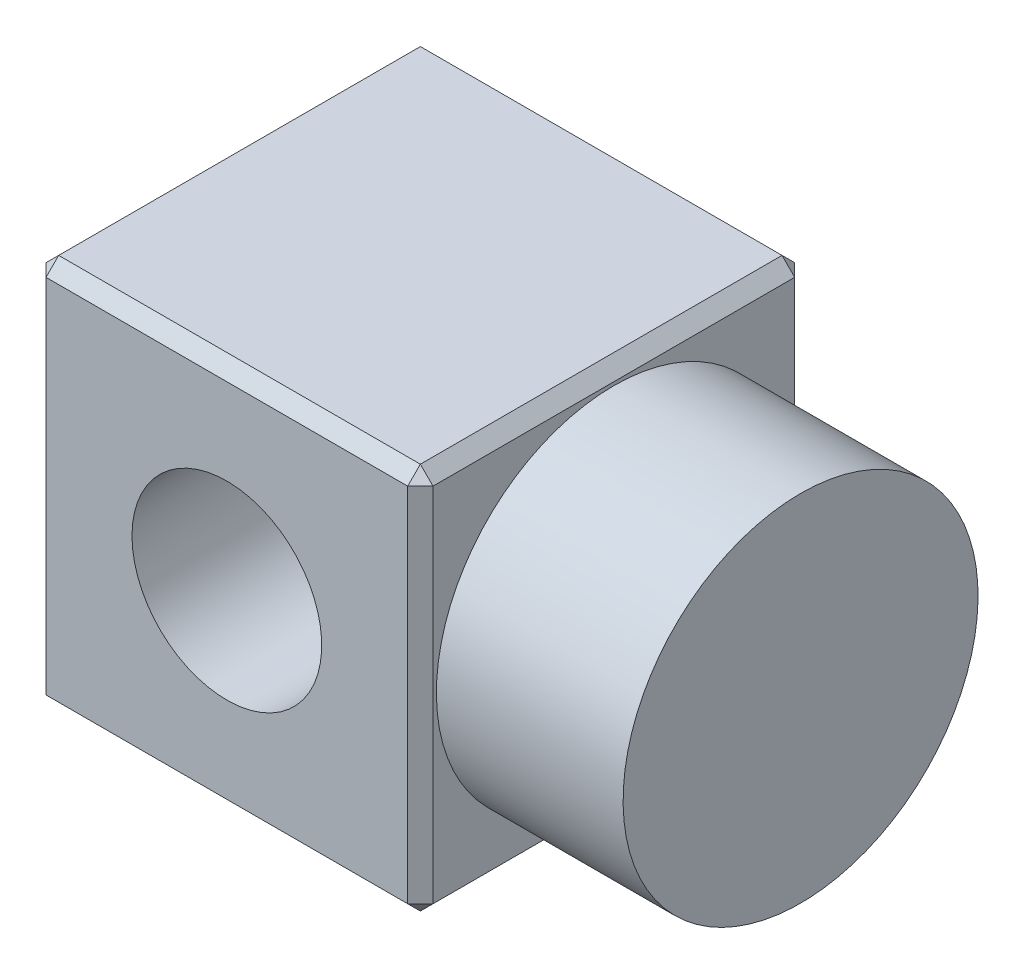
ISO-10303-21;
HEADER;
FILE_DESCRIPTION(('STEP AP214'),'2;1');
FILE_NAME('part.step','',(''),(''),'','','');
FILE_SCHEMA(('AUTOMOTIVE_DESIGN { 1 0 10303 214 1 1 1 1 }'));
ENDSEC;
DATA;
#1=APPLICATION_CONTEXT('core data for automotive mechanical design processes');
#2=APPLICATION_PROTOCOL_DEFINITION('international standard','automotive_design',2000,#1);
#3=PRODUCT_CONTEXT('',#1,'mechanical');
#4=PRODUCT('Part','Part','',(#3));
#5=PRODUCT_RELATED_PRODUCT_CATEGORY('part','',(#4));
#6=PRODUCT_DEFINITION_FORMATION('','',#4);
#7=PRODUCT_DEFINITION_CONTEXT('part definition',#1,'design');
#8=PRODUCT_DEFINITION('design','',#6,#7);
#9=PRODUCT_DEFINITION_SHAPE('','',#8);
#10=(LENGTH_UNIT() NAMED_UNIT(*) SI_UNIT(.MILLI.,.METRE.));
#11=(NAMED_UNIT(*) PLANE_ANGLE_UNIT() SI_UNIT($,.RADIAN.));
#12=(NAMED_UNIT(*) SI_UNIT($,.STERADIAN.) SOLID_ANGLE_UNIT());
#13=UNCERTAINTY_MEASURE_WITH_UNIT(LENGTH_MEASURE(1.E-05),#10,'distance_accuracy_value','');
#14=(GEOMETRIC_REPRESENTATION_CONTEXT(3) GLOBAL_UNCERTAINTY_ASSIGNED_CONTEXT((#13)) GLOBAL_UNIT_ASSIGNED_CONTEXT((#10,
#11,#12)) REPRESENTATION_CONTEXT('',''));
#15=CARTESIAN_POINT('',(0.,0.,0.));
#16=DIRECTION('',(0.,0.,1.));
#17=DIRECTION('',(1.,0.,0.));
#18=AXIS2_PLACEMENT_3D('',#15,#16,#17);
#19=CARTESIAN_POINT('',(1772.4105175513,38.1650000000007,-38.1650000000001));
#20=DIRECTION('',(0.,1.,0.));
#21=DIRECTION('',(-1.,0.,0.));
#22=AXIS2_PLACEMENT_3D('',#19,#20,#21);
#23=PLANE('',#22);
#24=DIRECTION('',(0.,0.,-1.));
#25=VECTOR('',#24,1.);
#26=CARTESIAN_POINT('',(1846.2405175513,38.1650000000008,-38.1650000000001));
#27=LINE('',#26,#25);
#28=CARTESIAN_POINT('',(1846.2405175513,38.1650000000008,35.665));
#29=VERTEX_POINT('',#28);
#30=CARTESIAN_POINT('',(1846.2405175513,38.1650000000008,-35.6650000000001));
#31=VERTEX_POINT('',#30);
#32=EDGE_CURVE('E180',#29,#31,#27,.T.);
#33=ORIENTED_EDGE('',*,*,#32,.T.);
#34=DIRECTION('',(-1.,0.,0.));
#35=VECTOR('',#34,1.);
#36=CARTESIAN_POINT('',(1772.4105175513,38.1650000000007,-35.6650000000001));
#37=LINE('',#36,#35);
#38=CARTESIAN_POINT('',(1774.9105175513,38.1650000000007,-35.6650000000001));
#39=VERTEX_POINT('',#38);
#40=EDGE_CURVE('E182',#31,#39,#37,.T.);
#41=ORIENTED_EDGE('',*,*,#40,.T.);
#42=DIRECTION('',(0.,0.,1.));
#43=VECTOR('',#42,1.);
#44=CARTESIAN_POINT('',(1774.9105175513,38.1650000000007,-38.1650000000001));
#45=LINE('',#44,#43);
#46=CARTESIAN_POINT('',(1774.9105175513,38.1650000000007,35.665));
#47=VERTEX_POINT('',#46);
#48=EDGE_CURVE('E176',#39,#47,#45,.T.);
#49=ORIENTED_EDGE('',*,*,#48,.T.);
#50=DIRECTION('',(1.,0.,0.));
#51=VECTOR('',#50,1.);
#52=CARTESIAN_POINT('',(1848.7405175513,38.1650000000008,35.665));
#53=LINE('',#52,#51);
#54=EDGE_CURVE('E178',#47,#29,#53,.T.);
#55=ORIENTED_EDGE('',*,*,#54,.T.);
#56=EDGE_LOOP('',(#33,#41,#49,#55));
#57=FACE_BOUND('',#56,.T.);
#58=ADVANCED_FACE('F33',(#57),#23,.T.);
#59=CARTESIAN_POINT('',(1772.4105175513,-38.1649999999993,-38.1650000000001));
#60=DIRECTION('',(0.,0.,-1.));
#61=DIRECTION('',(-1.,0.,0.));
#62=AXIS2_PLACEMENT_3D('',#59,#60,#61);
#63=PLANE('',#62);
#64=CARTESIAN_POINT('',(1810.5755175513,7.80625564189563E-13,-38.1650000000001));
#65=DIRECTION('',(0.,0.,-1.));
#66=DIRECTION('',(-1.,0.,0.));
#67=AXIS2_PLACEMENT_3D('',#64,#65,#66);
#68=CIRCLE('',#67,18.71);
#69=CARTESIAN_POINT('',(1791.8655175513,7.80625564189563E-13,-38.1650000000001));
#70=VERTEX_POINT('',#69);
#71=EDGE_CURVE('E272',#70,#70,#68,.T.);
#72=ORIENTED_EDGE('',*,*,#71,.F.);
#73=EDGE_LOOP('',(#72));
#74=FACE_BOUND('',#73,.T.);
#75=DIRECTION('',(1.,0.,0.));
#76=VECTOR('',#75,1.);
#77=CARTESIAN_POINT('',(1772.4105175513,35.6650000000008,-38.1650000000001));
#78=LINE('',#77,#76);
#79=CARTESIAN_POINT('',(1774.9105175513,35.6650000000008,-38.1650000000001));
#80=VERTEX_POINT('',#79);
#81=CARTESIAN_POINT('',(1846.2405175513,35.6650000000008,-38.1650000000001));
#82=VERTEX_POINT('',#81);
#83=EDGE_CURVE('E171',#80,#82,#78,.T.);
#84=ORIENTED_EDGE('',*,*,#83,.T.);
#85=DIRECTION('',(0.,-1.,0.));
#86=VECTOR('',#85,1.);
#87=CARTESIAN_POINT('',(1846.2405175513,-38.1649999999992,-38.1650000000001));
#88=LINE('',#87,#86);
#89=CARTESIAN_POINT('',(1846.2405175513,-35.6649999999992,-38.1650000000001));
#90=VERTEX_POINT('',#89);
#91=EDGE_CURVE('E173',#82,#90,#88,.T.);
#92=ORIENTED_EDGE('',*,*,#91,.T.);
#93=DIRECTION('',(-1.,0.,0.));
#94=VECTOR('',#93,1.);
#95=CARTESIAN_POINT('',(1772.4105175513,-35.6649999999993,-38.1650000000001));
#96=LINE('',#95,#94);
#97=CARTESIAN_POINT('',(1774.9105175513,-35.6649999999993,-38.1650000000001));
#98=VERTEX_POINT('',#97);
#99=EDGE_CURVE('E169',#90,#98,#96,.T.);
#100=ORIENTED_EDGE('',*,*,#99,.T.);
#101=DIRECTION('',(0.,1.,0.));
#102=VECTOR('',#101,1.);
#103=CARTESIAN_POINT('',(1774.9105175513,-38.1649999999993,-38.1650000000001));
#104=LINE('',#103,#102);
#105=EDGE_CURVE('E167',#98,#80,#104,.T.);
#106=ORIENTED_EDGE('',*,*,#105,.T.);
#107=EDGE_LOOP('',(#84,#92,#100,#106));
#108=FACE_BOUND('',#107,.T.);
#109=ADVANCED_FACE('F279',(#74,#108),#63,.T.);
#110=CARTESIAN_POINT('',(1772.4105175513,-38.1649999999993,-38.1650000000001));
#111=DIRECTION('',(0.,1.,0.));
#112=DIRECTION('',(-1.,0.,0.));
#113=AXIS2_PLACEMENT_3D('',#110,#111,#112);
#114=PLANE('',#113);
#115=DIRECTION('',(0.,0.,-1.));
#116=VECTOR('',#115,1.);
#117=CARTESIAN_POINT('',(1774.9105175513,-38.1649999999993,-38.1650000000001));
#118=LINE('',#117,#116);
#119=CARTESIAN_POINT('',(1774.9105175513,-38.1649999999993,35.665));
#120=VERTEX_POINT('',#119);
#121=CARTESIAN_POINT('',(1774.9105175513,-38.1649999999993,-35.6650000000001));
#122=VERTEX_POINT('',#121);
#123=EDGE_CURVE('E193',#120,#122,#118,.T.);
#124=ORIENTED_EDGE('',*,*,#123,.T.);
#125=DIRECTION('',(1.,0.,0.));
#126=VECTOR('',#125,1.);
#127=CARTESIAN_POINT('',(1848.7405175513,-38.1649999999992,-35.6650000000001));
#128=LINE('',#127,#126);
#129=CARTESIAN_POINT('',(1846.2405175513,-38.1649999999992,-35.6650000000001));
#130=VERTEX_POINT('',#129);
#131=EDGE_CURVE('E199',#122,#130,#128,.T.);
#132=ORIENTED_EDGE('',*,*,#131,.T.);
#133=DIRECTION('',(0.,0.,1.));
#134=VECTOR('',#133,1.);
#135=CARTESIAN_POINT('',(1846.2405175513,-38.1649999999992,-38.1650000000001));
#136=LINE('',#135,#134);
#137=CARTESIAN_POINT('',(1846.2405175513,-38.1649999999992,35.665));
#138=VERTEX_POINT('',#137);
#139=EDGE_CURVE('E197',#130,#138,#136,.T.);
#140=ORIENTED_EDGE('',*,*,#139,.T.);
#141=DIRECTION('',(-1.,0.,0.));
#142=VECTOR('',#141,1.);
#143=CARTESIAN_POINT('',(1772.4105175513,-38.1649999999993,35.665));
#144=LINE('',#143,#142);
#145=EDGE_CURVE('E195',#138,#120,#144,.T.);
#146=ORIENTED_EDGE('',*,*,#145,.T.);
#147=EDGE_LOOP('',(#124,#132,#140,#146));
#148=FACE_BOUND('',#147,.T.);
#149=ADVANCED_FACE('F282',(#148),#114,.F.);
#150=CARTESIAN_POINT('',(1772.4105175513,-38.1649999999993,38.1649999999999));
#151=DIRECTION('',(0.,0.,-1.));
#152=DIRECTION('',(-1.,0.,0.));
#153=AXIS2_PLACEMENT_3D('',#150,#151,#152);
#154=PLANE('',#153);
#155=CARTESIAN_POINT('',(1810.5755175513,7.80625564189563E-13,38.1649999999999));
#156=DIRECTION('',(0.,0.,-1.));
#157=DIRECTION('',(-1.,0.,0.));
#158=AXIS2_PLACEMENT_3D('',#155,#156,#157);
#159=CIRCLE('',#158,18.71);
#160=CARTESIAN_POINT('',(1791.8655175513,7.80625564189563E-13,38.1649999999999));
#161=VERTEX_POINT('',#160);
#162=EDGE_CURVE('E209',#161,#161,#159,.F.);
#163=ORIENTED_EDGE('',*,*,#162,.F.);
#164=EDGE_LOOP('',(#163));
#165=FACE_BOUND('',#164,.T.);
#166=DIRECTION('',(0.,1.,0.));
#167=VECTOR('',#166,1.);
#168=CARTESIAN_POINT('',(1846.2405175513,-38.1649999999993,38.1649999999999));
#169=LINE('',#168,#167);
#170=CARTESIAN_POINT('',(1846.2405175513,-35.6649999999993,38.1649999999999));
#171=VERTEX_POINT('',#170);
#172=CARTESIAN_POINT('',(1846.2405175513,35.6650000000008,38.1649999999999));
#173=VERTEX_POINT('',#172);
#174=EDGE_CURVE('E139',#171,#173,#169,.T.);
#175=ORIENTED_EDGE('',*,*,#174,.T.);
#176=DIRECTION('',(-1.,0.,0.));
#177=VECTOR('',#176,1.);
#178=CARTESIAN_POINT('',(1772.4105175513,35.6650000000008,38.1649999999999));
#179=LINE('',#178,#177);
#180=CARTESIAN_POINT('',(1774.9105175513,35.6650000000008,38.1649999999999));
#181=VERTEX_POINT('',#180);
#182=EDGE_CURVE('E190',#173,#181,#179,.T.);
#183=ORIENTED_EDGE('',*,*,#182,.T.);
#184=DIRECTION('',(0.,-1.,0.));
#185=VECTOR('',#184,1.);
#186=CARTESIAN_POINT('',(1774.9105175513,-38.1649999999993,38.1649999999999));
#187=LINE('',#186,#185);
#188=CARTESIAN_POINT('',(1774.9105175513,-35.6649999999993,38.1649999999999));
#189=VERTEX_POINT('',#188);
#190=EDGE_CURVE('E185',#181,#189,#187,.T.);
#191=ORIENTED_EDGE('',*,*,#190,.T.);
#192=DIRECTION('',(1.,0.,0.));
#193=VECTOR('',#192,1.);
#194=CARTESIAN_POINT('',(1772.4105175513,-35.6649999999993,38.1649999999999));
#195=LINE('',#194,#193);
#196=EDGE_CURVE('E187',#189,#171,#195,.T.);
#197=ORIENTED_EDGE('',*,*,#196,.T.);
#198=EDGE_LOOP('',(#175,#183,#191,#197));
#199=FACE_BOUND('',#198,.T.);
#200=ADVANCED_FACE('F311',(#165,#199),#154,.F.);
#201=CARTESIAN_POINT('',(1772.4105175513,0.,0.));
#202=DIRECTION('',(-1.,0.,0.));
#203=DIRECTION('',(0.,0.,1.));
#204=AXIS2_PLACEMENT_3D('',#201,#202,#203);
#205=PLANE('',#204);
#206=DIRECTION('',(0.,0.,1.));
#207=VECTOR('',#206,1.);
#208=CARTESIAN_POINT('',(1772.4105175513,-35.6649999999993,38.1649999999999));
#209=LINE('',#208,#207);
#210=CARTESIAN_POINT('',(1772.4105175513,-35.6649999999993,-35.6650000000001));
#211=VERTEX_POINT('',#210);
#212=CARTESIAN_POINT('',(1772.4105175513,-35.6649999999993,35.665));
#213=VERTEX_POINT('',#212);
#214=EDGE_CURVE('E42',#211,#213,#209,.T.);
#215=ORIENTED_EDGE('',*,*,#214,.T.);
#216=DIRECTION('',(0.,1.,0.));
#217=VECTOR('',#216,1.);
#218=CARTESIAN_POINT('',(1772.4105175513,38.1650000000007,35.665));
#219=LINE('',#218,#217);
#220=CARTESIAN_POINT('',(1772.4105175513,35.6650000000008,35.665));
#221=VERTEX_POINT('',#220);
#222=EDGE_CURVE('E11',#213,#221,#219,.T.);
#223=ORIENTED_EDGE('',*,*,#222,.T.);
#224=DIRECTION('',(0.,0.,-1.));
#225=VECTOR('',#224,1.);
#226=CARTESIAN_POINT('',(1772.4105175513,35.6650000000008,0.));
#227=LINE('',#226,#225);
#228=CARTESIAN_POINT('',(1772.4105175513,35.6650000000008,-35.6650000000001));
#229=VERTEX_POINT('',#228);
#230=EDGE_CURVE('E202',#221,#229,#227,.T.);
#231=ORIENTED_EDGE('',*,*,#230,.T.);
#232=DIRECTION('',(0.,-1.,0.));
#233=VECTOR('',#232,1.);
#234=CARTESIAN_POINT('',(1772.4105175513,0.,-35.6650000000001));
#235=LINE('',#234,#233);
#236=EDGE_CURVE('E53',#229,#211,#235,.T.);
#237=ORIENTED_EDGE('',*,*,#236,.T.);
#238=EDGE_LOOP('',(#215,#223,#231,#237));
#239=FACE_BOUND('',#238,.T.);
#240=ADVANCED_FACE('F358',(#239),#205,.T.);
#241=CARTESIAN_POINT('',(1848.7405175513,0.,0.));
#242=DIRECTION('',(-1.,0.,0.));
#243=DIRECTION('',(0.,0.,1.));
#244=AXIS2_PLACEMENT_3D('',#241,#242,#243);
#245=PLANE('',#244);
#246=DIRECTION('',(0.,0.,-1.));
#247=VECTOR('',#246,1.);
#248=CARTESIAN_POINT('',(1848.7405175513,-35.6649999999992,0.));
#249=LINE('',#248,#247);
#250=CARTESIAN_POINT('',(1848.7405175513,-35.6649999999992,35.665));
#251=VERTEX_POINT('',#250);
#252=CARTESIAN_POINT('',(1848.7405175513,-35.6649999999992,-35.6650000000001));
#253=VERTEX_POINT('',#252);
#254=EDGE_CURVE('E126',#251,#253,#249,.T.);
#255=ORIENTED_EDGE('',*,*,#254,.T.);
#256=DIRECTION('',(0.,1.,0.));
#257=VECTOR('',#256,1.);
#258=CARTESIAN_POINT('',(1848.7405175513,38.1650000000008,-35.6650000000001));
#259=LINE('',#258,#257);
#260=CARTESIAN_POINT('',(1848.7405175513,35.6650000000008,-35.6650000000001));
#261=VERTEX_POINT('',#260);
#262=EDGE_CURVE('E165',#253,#261,#259,.T.);
#263=ORIENTED_EDGE('',*,*,#262,.T.);
#264=DIRECTION('',(0.,0.,1.));
#265=VECTOR('',#264,1.);
#266=CARTESIAN_POINT('',(1848.7405175513,35.6650000000008,38.1649999999999));
#267=LINE('',#266,#265);
#268=CARTESIAN_POINT('',(1848.7405175513,35.6650000000008,35.665));
#269=VERTEX_POINT('',#268);
#270=EDGE_CURVE('E129',#261,#269,#267,.T.);
#271=ORIENTED_EDGE('',*,*,#270,.T.);
#272=DIRECTION('',(0.,-1.,0.));
#273=VECTOR('',#272,1.);
#274=CARTESIAN_POINT('',(1848.7405175513,0.,35.665));
#275=LINE('',#274,#273);
#276=EDGE_CURVE('E120',#269,#251,#275,.T.);
#277=ORIENTED_EDGE('',*,*,#276,.T.);
#278=EDGE_LOOP('',(#255,#263,#271,#277));
#279=FACE_BOUND('',#278,.T.);
#280=CARTESIAN_POINT('',(1848.7405175513,0.,0.));
#281=DIRECTION('',(1.,0.,0.));
#282=DIRECTION('',(0.,1.,0.));
#283=AXIS2_PLACEMENT_3D('',#280,#281,#282);
#284=CIRCLE('',#283,35.);
#285=CARTESIAN_POINT('',(1848.7405175513,35.,0.));
#286=VERTEX_POINT('',#285);
#287=EDGE_CURVE('E157',#286,#286,#284,.T.);
#288=ORIENTED_EDGE('',*,*,#287,.F.);
#289=EDGE_LOOP('',(#288));
#290=FACE_BOUND('',#289,.T.);
#291=ADVANCED_FACE('F122',(#279,#290),#245,.F.);
#292=CARTESIAN_POINT('',(1885.5605175513,0.,0.));
#293=DIRECTION('',(-1.,0.,0.));
#294=DIRECTION('',(0.,-1.,0.));
#295=AXIS2_PLACEMENT_3D('',#292,#293,#294);
#296=CYLINDRICAL_SURFACE('',#295,35.);
#297=CARTESIAN_POINT('',(1885.5605175513,0.,0.));
#298=DIRECTION('',(1.,0.,0.));
#299=DIRECTION('',(0.,1.,0.));
#300=AXIS2_PLACEMENT_3D('',#297,#298,#299);
#301=CIRCLE('',#300,35.);
#302=CARTESIAN_POINT('',(1885.5605175513,35.,0.));
#303=VERTEX_POINT('',#302);
#304=EDGE_CURVE('E160',#303,#303,#301,.T.);
#305=ORIENTED_EDGE('',*,*,#304,.F.);
#306=EDGE_LOOP('',(#305));
#307=FACE_BOUND('',#306,.T.);
#308=ORIENTED_EDGE('',*,*,#287,.T.);
#309=EDGE_LOOP('',(#308));
#310=FACE_BOUND('',#309,.T.);
#311=ADVANCED_FACE('F354',(#307,#310),#296,.T.);
#312=CARTESIAN_POINT('',(1885.5605175513,0.,0.));
#313=DIRECTION('',(1.,0.,0.));
#314=DIRECTION('',(0.,1.,0.));
#315=AXIS2_PLACEMENT_3D('',#312,#313,#314);
#316=PLANE('',#315);
#317=ORIENTED_EDGE('',*,*,#304,.T.);
#318=EDGE_LOOP('',(#317));
#319=FACE_BOUND('',#318,.T.);
#320=ADVANCED_FACE('F351',(#319),#316,.T.);
#321=CARTESIAN_POINT('',(1772.4105175513,0.,35.665));
#322=DIRECTION('',(-0.707106781186551,0.,0.707106781186544));
#323=DIRECTION('',(0.,-1.,0.));
#324=AXIS2_PLACEMENT_3D('',#321,#322,#323);
#325=PLANE('',#324);
#326=DIRECTION('',(-0.707106781186544,0.,-0.707106781186551));
#327=VECTOR('',#326,1.);
#328=CARTESIAN_POINT('',(1773.6605175513,-35.6649999999993,36.9149999999999));
#329=LINE('',#328,#327);
#330=EDGE_CURVE('E37',#189,#213,#329,.T.);
#331=ORIENTED_EDGE('',*,*,#330,.F.);
#332=ORIENTED_EDGE('',*,*,#190,.F.);
#333=DIRECTION('',(0.707106781186544,0.,0.707106781186551));
#334=VECTOR('',#333,1.);
#335=CARTESIAN_POINT('',(1774.9105175513,35.6650000000008,38.1649999999999));
#336=LINE('',#335,#334);
#337=EDGE_CURVE('E254',#221,#181,#336,.T.);
#338=ORIENTED_EDGE('',*,*,#337,.F.);
#339=ORIENTED_EDGE('',*,*,#222,.F.);
#340=EDGE_LOOP('',(#331,#332,#338,#339));
#341=FACE_BOUND('',#340,.T.);
#342=ADVANCED_FACE('F35',(#341),#325,.T.);
#343=CARTESIAN_POINT('',(1774.9105175513,-38.1649999999993,35.665));
#344=DIRECTION('',(-0.577350269189632,-0.577350269189626,0.577350269189619));
#345=DIRECTION('',(0.707106781186544,-0.707106781186551,0.));
#346=AXIS2_PLACEMENT_3D('',#343,#344,#345);
#347=PLANE('',#346);
#348=DIRECTION('',(0.,-0.707106781186544,-0.707106781186551));
#349=VECTOR('',#348,1.);
#350=CARTESIAN_POINT('',(1774.9105175513,-38.1649999999993,35.665));
#351=LINE('',#350,#349);
#352=EDGE_CURVE('E249',#189,#120,#351,.T.);
#353=ORIENTED_EDGE('',*,*,#352,.F.);
#354=ORIENTED_EDGE('',*,*,#330,.T.);
#355=DIRECTION('',(0.707106781186544,-0.707106781186551,0.));
#356=VECTOR('',#355,1.);
#357=CARTESIAN_POINT('',(1774.9105175513,-38.1649999999993,35.665));
#358=LINE('',#357,#356);
#359=EDGE_CURVE('E252',#120,#213,#358,.F.);
#360=ORIENTED_EDGE('',*,*,#359,.F.);
#361=EDGE_LOOP('',(#353,#354,#360));
#362=FACE_BOUND('',#361,.T.);
#363=ADVANCED_FACE('F393',(#362),#347,.T.);
#364=CARTESIAN_POINT('',(1774.9105175513,35.6650000000008,38.1649999999999));
#365=DIRECTION('',(-0.577350269189632,0.577350269189619,0.577350269189626));
#366=DIRECTION('',(0.707106781186544,0.,0.707106781186551));
#367=AXIS2_PLACEMENT_3D('',#364,#365,#366);
#368=PLANE('',#367);
#369=DIRECTION('',(0.707106781186544,0.707106781186551,0.));
#370=VECTOR('',#369,1.);
#371=CARTESIAN_POINT('',(1773.6605175513,36.9150000000008,35.665));
#372=LINE('',#371,#370);
#373=EDGE_CURVE('E244',#221,#47,#372,.T.);
#374=ORIENTED_EDGE('',*,*,#373,.F.);
#375=ORIENTED_EDGE('',*,*,#337,.T.);
#376=DIRECTION('',(0.,0.707106781186551,-0.707106781186544));
#377=VECTOR('',#376,1.);
#378=CARTESIAN_POINT('',(1774.9105175513,35.6650000000008,38.1649999999999));
#379=LINE('',#378,#377);
#380=EDGE_CURVE('E247',#47,#181,#379,.F.);
#381=ORIENTED_EDGE('',*,*,#380,.F.);
#382=EDGE_LOOP('',(#374,#375,#381));
#383=FACE_BOUND('',#382,.T.);
#384=ADVANCED_FACE('F400',(#383),#368,.T.);
#385=CARTESIAN_POINT('',(1772.4105175513,-35.6649999999993,0.));
#386=DIRECTION('',(-0.707106781186551,-0.707106781186544,0.));
#387=DIRECTION('',(0.,0.,-1.));
#388=AXIS2_PLACEMENT_3D('',#385,#386,#387);
#389=PLANE('',#388);
#390=ORIENTED_EDGE('',*,*,#359,.T.);
#391=ORIENTED_EDGE('',*,*,#214,.F.);
#392=DIRECTION('',(-0.707106781186544,0.707106781186551,0.));
#393=VECTOR('',#392,1.);
#394=CARTESIAN_POINT('',(1773.6605175513,-36.9149999999993,-35.6650000000001));
#395=LINE('',#394,#393);
#396=EDGE_CURVE('E238',#122,#211,#395,.T.);
#397=ORIENTED_EDGE('',*,*,#396,.F.);
#398=ORIENTED_EDGE('',*,*,#123,.F.);
#399=EDGE_LOOP('',(#390,#391,#397,#398));
#400=FACE_BOUND('',#399,.T.);
#401=ADVANCED_FACE('F406',(#400),#389,.T.);
#402=CARTESIAN_POINT('',(1772.4105175513,-35.6649999999993,38.1649999999999));
#403=DIRECTION('',(0.,0.707106781186551,-0.707106781186544));
#404=DIRECTION('',(1.,0.,0.));
#405=AXIS2_PLACEMENT_3D('',#402,#403,#404);
#406=PLANE('',#405);
#407=ORIENTED_EDGE('',*,*,#352,.T.);
#408=ORIENTED_EDGE('',*,*,#145,.F.);
#409=DIRECTION('',(0.,0.707106781186543,0.707106781186551));
#410=VECTOR('',#409,1.);
#411=CARTESIAN_POINT('',(1846.2405175513,-36.9149999999992,36.9149999999999));
#412=LINE('',#411,#410);
#413=EDGE_CURVE('E143',#171,#138,#412,.F.);
#414=ORIENTED_EDGE('',*,*,#413,.F.);
#415=ORIENTED_EDGE('',*,*,#196,.F.);
#416=EDGE_LOOP('',(#407,#408,#414,#415));
#417=FACE_BOUND('',#416,.T.);
#418=ADVANCED_FACE('F314',(#417),#406,.F.);
#419=CARTESIAN_POINT('',(1846.2405175513,-38.1649999999993,38.1649999999999));
#420=DIRECTION('',(-0.707106781186551,0.,-0.707106781186544));
#421=DIRECTION('',(0.,1.,0.));
#422=AXIS2_PLACEMENT_3D('',#419,#420,#421);
#423=PLANE('',#422);
#424=DIRECTION('',(-0.707106781186544,0.,0.707106781186551));
#425=VECTOR('',#424,1.);
#426=CARTESIAN_POINT('',(1848.7405175513,35.6650000000008,35.665));
#427=LINE('',#426,#425);
#428=EDGE_CURVE('E144',#173,#269,#427,.F.);
#429=ORIENTED_EDGE('',*,*,#428,.F.);
#430=ORIENTED_EDGE('',*,*,#174,.F.);
#431=DIRECTION('',(0.707106781186544,0.,-0.707106781186551));
#432=VECTOR('',#431,1.);
#433=CARTESIAN_POINT('',(1848.7405175513,-35.6649999999992,35.665));
#434=LINE('',#433,#432);
#435=EDGE_CURVE('E136',#251,#171,#434,.F.);
#436=ORIENTED_EDGE('',*,*,#435,.F.);
#437=ORIENTED_EDGE('',*,*,#276,.F.);
#438=EDGE_LOOP('',(#429,#430,#436,#437));
#439=FACE_BOUND('',#438,.T.);
#440=ADVANCED_FACE('F138',(#439),#423,.F.);
#441=CARTESIAN_POINT('',(1772.4105175513,38.1650000000007,35.665));
#442=DIRECTION('',(0.,0.707106781186544,0.707106781186551));
#443=DIRECTION('',(-1.,0.,0.));
#444=AXIS2_PLACEMENT_3D('',#441,#442,#443);
#445=PLANE('',#444);
#446=ORIENTED_EDGE('',*,*,#380,.T.);
#447=ORIENTED_EDGE('',*,*,#182,.F.);
#448=DIRECTION('',(0.,-0.707106781186551,0.707106781186544));
#449=VECTOR('',#448,1.);
#450=CARTESIAN_POINT('',(1846.2405175513,36.9150000000008,36.915));
#451=LINE('',#450,#449);
#452=EDGE_CURVE('E233',#29,#173,#451,.T.);
#453=ORIENTED_EDGE('',*,*,#452,.F.);
#454=ORIENTED_EDGE('',*,*,#54,.F.);
#455=EDGE_LOOP('',(#446,#447,#453,#454));
#456=FACE_BOUND('',#455,.T.);
#457=ADVANCED_FACE('F309',(#456),#445,.T.);
#458=CARTESIAN_POINT('',(1774.9105175513,38.1650000000007,-38.1650000000001));
#459=DIRECTION('',(0.707106781186551,-0.707106781186544,0.));
#460=DIRECTION('',(0.,0.,1.));
#461=AXIS2_PLACEMENT_3D('',#458,#459,#460);
#462=PLANE('',#461);
#463=ORIENTED_EDGE('',*,*,#373,.T.);
#464=ORIENTED_EDGE('',*,*,#48,.F.);
#465=DIRECTION('',(-0.707106781186544,-0.707106781186551,0.));
#466=VECTOR('',#465,1.);
#467=CARTESIAN_POINT('',(1774.9105175513,38.1650000000007,-35.6650000000001));
#468=LINE('',#467,#466);
#469=EDGE_CURVE('E230',#229,#39,#468,.F.);
#470=ORIENTED_EDGE('',*,*,#469,.F.);
#471=ORIENTED_EDGE('',*,*,#230,.F.);
#472=EDGE_LOOP('',(#463,#464,#470,#471));
#473=FACE_BOUND('',#472,.T.);
#474=ADVANCED_FACE('F432',(#473),#462,.F.);
#475=CARTESIAN_POINT('',(1774.9105175513,-38.1649999999993,-38.1650000000001));
#476=DIRECTION('',(0.707106781186551,0.,0.707106781186544));
#477=DIRECTION('',(0.,1.,0.));
#478=AXIS2_PLACEMENT_3D('',#475,#476,#477);
#479=PLANE('',#478);
#480=DIRECTION('',(-0.707106781186544,0.,0.707106781186551));
#481=VECTOR('',#480,1.);
#482=CARTESIAN_POINT('',(1774.9105175513,-35.6649999999993,-38.1650000000001));
#483=LINE('',#482,#481);
#484=EDGE_CURVE('E241',#211,#98,#483,.F.);
#485=ORIENTED_EDGE('',*,*,#484,.F.);
#486=ORIENTED_EDGE('',*,*,#236,.F.);
#487=DIRECTION('',(0.707106781186544,0.,-0.707106781186551));
#488=VECTOR('',#487,1.);
#489=CARTESIAN_POINT('',(1773.6605175513,35.6650000000008,-36.9150000000001));
#490=LINE('',#489,#488);
#491=EDGE_CURVE('E227',#80,#229,#490,.F.);
#492=ORIENTED_EDGE('',*,*,#491,.F.);
#493=ORIENTED_EDGE('',*,*,#105,.F.);
#494=EDGE_LOOP('',(#485,#486,#492,#493));
#495=FACE_BOUND('',#494,.T.);
#496=ADVANCED_FACE('F439',(#495),#479,.F.);
#497=CARTESIAN_POINT('',(1774.9105175513,-35.6649999999993,-38.1650000000001));
#498=DIRECTION('',(-0.577350269189632,-0.577350269189619,-0.577350269189626));
#499=DIRECTION('',(-0.707106781186544,0.,0.707106781186551));
#500=AXIS2_PLACEMENT_3D('',#497,#498,#499);
#501=PLANE('',#500);
#502=ORIENTED_EDGE('',*,*,#396,.T.);
#503=ORIENTED_EDGE('',*,*,#484,.T.);
#504=DIRECTION('',(0.,-0.707106781186551,0.707106781186544));
#505=VECTOR('',#504,1.);
#506=CARTESIAN_POINT('',(1774.9105175513,-35.6649999999993,-38.1650000000001));
#507=LINE('',#506,#505);
#508=EDGE_CURVE('E151',#122,#98,#507,.F.);
#509=ORIENTED_EDGE('',*,*,#508,.F.);
#510=EDGE_LOOP('',(#502,#503,#509));
#511=FACE_BOUND('',#510,.T.);
#512=ADVANCED_FACE('F447',(#511),#501,.T.);
#513=CARTESIAN_POINT('',(1848.7405175513,-35.6649999999992,35.665));
#514=DIRECTION('',(0.577350269189632,-0.577350269189626,0.577350269189619));
#515=DIRECTION('',(0.707106781186544,0.707106781186551,0.));
#516=AXIS2_PLACEMENT_3D('',#513,#514,#515);
#517=PLANE('',#516);
#518=ORIENTED_EDGE('',*,*,#435,.T.);
#519=ORIENTED_EDGE('',*,*,#413,.T.);
#520=DIRECTION('',(-0.707106781186544,-0.707106781186551,0.));
#521=VECTOR('',#520,1.);
#522=CARTESIAN_POINT('',(1848.7405175513,-35.6649999999992,35.665));
#523=LINE('',#522,#521);
#524=EDGE_CURVE('E147',#251,#138,#523,.T.);
#525=ORIENTED_EDGE('',*,*,#524,.F.);
#526=EDGE_LOOP('',(#518,#519,#525));
#527=FACE_BOUND('',#526,.T.);
#528=ADVANCED_FACE('F148',(#527),#517,.T.);
#529=CARTESIAN_POINT('',(1848.7405175513,35.6650000000008,35.665));
#530=DIRECTION('',(0.577350269189632,0.577350269189619,0.577350269189626));
#531=DIRECTION('',(0.707106781186544,0.,-0.707106781186551));
#532=AXIS2_PLACEMENT_3D('',#529,#530,#531);
#533=PLANE('',#532);
#534=ORIENTED_EDGE('',*,*,#452,.T.);
#535=ORIENTED_EDGE('',*,*,#428,.T.);
#536=DIRECTION('',(-0.707106781186544,0.707106781186551,0.));
#537=VECTOR('',#536,1.);
#538=CARTESIAN_POINT('',(1848.7405175513,35.6650000000008,35.665));
#539=LINE('',#538,#537);
#540=EDGE_CURVE('E152',#29,#269,#539,.F.);
#541=ORIENTED_EDGE('',*,*,#540,.F.);
#542=EDGE_LOOP('',(#534,#535,#541));
#543=FACE_BOUND('',#542,.T.);
#544=ADVANCED_FACE('F304',(#543),#533,.T.);
#545=CARTESIAN_POINT('',(1774.9105175513,38.1650000000007,-35.6650000000001));
#546=DIRECTION('',(-0.577350269189632,0.577350269189619,-0.577350269189626));
#547=DIRECTION('',(-0.707106781186544,0.,0.707106781186551));
#548=AXIS2_PLACEMENT_3D('',#545,#546,#547);
#549=PLANE('',#548);
#550=ORIENTED_EDGE('',*,*,#491,.T.);
#551=ORIENTED_EDGE('',*,*,#469,.T.);
#552=DIRECTION('',(0.,0.707106781186551,0.707106781186544));
#553=VECTOR('',#552,1.);
#554=CARTESIAN_POINT('',(1774.9105175513,38.1650000000007,-35.6650000000001));
#555=LINE('',#554,#553);
#556=EDGE_CURVE('E221',#80,#39,#555,.T.);
#557=ORIENTED_EDGE('',*,*,#556,.F.);
#558=EDGE_LOOP('',(#550,#551,#557));
#559=FACE_BOUND('',#558,.T.);
#560=ADVANCED_FACE('F468',(#559),#549,.T.);
#561=CARTESIAN_POINT('',(1772.4105175513,-38.1649999999993,-35.6650000000001));
#562=DIRECTION('',(0.,-0.707106781186544,-0.707106781186551));
#563=DIRECTION('',(-1.,0.,0.));
#564=AXIS2_PLACEMENT_3D('',#561,#562,#563);
#565=PLANE('',#564);
#566=ORIENTED_EDGE('',*,*,#508,.T.);
#567=ORIENTED_EDGE('',*,*,#99,.F.);
#568=DIRECTION('',(0.,0.707106781186551,-0.707106781186543));
#569=VECTOR('',#568,1.);
#570=CARTESIAN_POINT('',(1846.2405175513,-35.6649999999992,-38.1650000000001));
#571=LINE('',#570,#569);
#572=EDGE_CURVE('E218',#130,#90,#571,.T.);
#573=ORIENTED_EDGE('',*,*,#572,.F.);
#574=ORIENTED_EDGE('',*,*,#131,.F.);
#575=EDGE_LOOP('',(#566,#567,#573,#574));
#576=FACE_BOUND('',#575,.T.);
#577=ADVANCED_FACE('F322',(#576),#565,.T.);
#578=CARTESIAN_POINT('',(1846.2405175513,-38.1649999999992,-38.1650000000001));
#579=DIRECTION('',(-0.707106781186551,0.707106781186544,0.));
#580=DIRECTION('',(0.,0.,1.));
#581=AXIS2_PLACEMENT_3D('',#578,#579,#580);
#582=PLANE('',#581);
#583=ORIENTED_EDGE('',*,*,#524,.T.);
#584=ORIENTED_EDGE('',*,*,#139,.F.);
#585=DIRECTION('',(0.707106781186543,0.707106781186551,0.));
#586=VECTOR('',#585,1.);
#587=CARTESIAN_POINT('',(1847.4905175513,-36.9149999999992,-35.6650000000001));
#588=LINE('',#587,#586);
#589=EDGE_CURVE('E155',#253,#130,#588,.F.);
#590=ORIENTED_EDGE('',*,*,#589,.F.);
#591=ORIENTED_EDGE('',*,*,#254,.F.);
#592=EDGE_LOOP('',(#583,#584,#590,#591));
#593=FACE_BOUND('',#592,.T.);
#594=ADVANCED_FACE('F154',(#593),#582,.F.);
#595=CARTESIAN_POINT('',(1848.7405175513,35.6650000000008,0.));
#596=DIRECTION('',(0.707106781186551,0.707106781186544,0.));
#597=DIRECTION('',(0.,0.,-1.));
#598=AXIS2_PLACEMENT_3D('',#595,#596,#597);
#599=PLANE('',#598);
#600=ORIENTED_EDGE('',*,*,#540,.T.);
#601=ORIENTED_EDGE('',*,*,#270,.F.);
#602=DIRECTION('',(0.707106781186543,-0.707106781186551,0.));
#603=VECTOR('',#602,1.);
#604=CARTESIAN_POINT('',(1848.7405175513,35.6650000000008,-35.6650000000001));
#605=LINE('',#604,#603);
#606=EDGE_CURVE('E214',#31,#261,#605,.T.);
#607=ORIENTED_EDGE('',*,*,#606,.F.);
#608=ORIENTED_EDGE('',*,*,#32,.F.);
#609=EDGE_LOOP('',(#600,#601,#607,#608));
#610=FACE_BOUND('',#609,.T.);
#611=ADVANCED_FACE('F301',(#610),#599,.T.);
#612=CARTESIAN_POINT('',(1772.4105175513,35.6650000000008,-38.1650000000001));
#613=DIRECTION('',(0.,-0.707106781186544,0.707106781186551));
#614=DIRECTION('',(1.,0.,0.));
#615=AXIS2_PLACEMENT_3D('',#612,#613,#614);
#616=PLANE('',#615);
#617=ORIENTED_EDGE('',*,*,#556,.T.);
#618=ORIENTED_EDGE('',*,*,#40,.F.);
#619=DIRECTION('',(0.,-0.707106781186551,-0.707106781186544));
#620=VECTOR('',#619,1.);
#621=CARTESIAN_POINT('',(1846.2405175513,36.9150000000008,-36.9150000000001));
#622=LINE('',#621,#620);
#623=EDGE_CURVE('E211',#82,#31,#622,.F.);
#624=ORIENTED_EDGE('',*,*,#623,.F.);
#625=ORIENTED_EDGE('',*,*,#83,.F.);
#626=EDGE_LOOP('',(#617,#618,#624,#625));
#627=FACE_BOUND('',#626,.T.);
#628=ADVANCED_FACE('F291',(#627),#616,.F.);
#629=CARTESIAN_POINT('',(1846.2405175513,-35.6649999999992,-38.1650000000001));
#630=DIRECTION('',(0.577350269189628,-0.577350269189622,-0.577350269189628));
#631=DIRECTION('',(-0.707106781186547,0.,-0.707106781186547));
#632=AXIS2_PLACEMENT_3D('',#629,#630,#631);
#633=PLANE('',#632);
#634=ORIENTED_EDGE('',*,*,#589,.T.);
#635=ORIENTED_EDGE('',*,*,#572,.T.);
#636=DIRECTION('',(0.707106781186548,0.,0.707106781186548));
#637=VECTOR('',#636,1.);
#638=CARTESIAN_POINT('',(1846.2405175513,-35.6649999999992,-38.1650000000001));
#639=LINE('',#638,#637);
#640=EDGE_CURVE('E208',#253,#90,#639,.F.);
#641=ORIENTED_EDGE('',*,*,#640,.F.);
#642=EDGE_LOOP('',(#634,#635,#641));
#643=FACE_BOUND('',#642,.T.);
#644=ADVANCED_FACE('F326',(#643),#633,.T.);
#645=CARTESIAN_POINT('',(1848.7405175513,35.6650000000008,-35.6650000000001));
#646=DIRECTION('',(0.577350269189628,0.577350269189622,-0.577350269189628));
#647=DIRECTION('',(-0.707106781186547,0.,-0.707106781186547));
#648=AXIS2_PLACEMENT_3D('',#645,#646,#647);
#649=PLANE('',#648);
#650=ORIENTED_EDGE('',*,*,#623,.T.);
#651=ORIENTED_EDGE('',*,*,#606,.T.);
#652=DIRECTION('',(-0.707106781186548,0.,-0.707106781186548));
#653=VECTOR('',#652,1.);
#654=CARTESIAN_POINT('',(1848.7405175513,35.6650000000008,-35.6650000000001));
#655=LINE('',#654,#653);
#656=EDGE_CURVE('E206',#82,#261,#655,.F.);
#657=ORIENTED_EDGE('',*,*,#656,.F.);
#658=EDGE_LOOP('',(#650,#651,#657));
#659=FACE_BOUND('',#658,.T.);
#660=ADVANCED_FACE('F298',(#659),#649,.T.);
#661=CARTESIAN_POINT('',(1848.7405175513,0.,-35.6650000000001));
#662=DIRECTION('',(0.707106781186548,0.,-0.707106781186548));
#663=DIRECTION('',(0.,-1.,0.));
#664=AXIS2_PLACEMENT_3D('',#661,#662,#663);
#665=PLANE('',#664);
#666=ORIENTED_EDGE('',*,*,#640,.T.);
#667=ORIENTED_EDGE('',*,*,#91,.F.);
#668=ORIENTED_EDGE('',*,*,#656,.T.);
#669=ORIENTED_EDGE('',*,*,#262,.F.);
#670=EDGE_LOOP('',(#666,#667,#668,#669));
#671=FACE_BOUND('',#670,.T.);
#672=ADVANCED_FACE('F296',(#671),#665,.T.);
#673=CARTESIAN_POINT('',(1810.5755175513,7.80625564189563E-13,38.1659999999999));
#674=DIRECTION('',(0.,0.,-1.));
#675=DIRECTION('',(-1.,0.,0.));
#676=AXIS2_PLACEMENT_3D('',#673,#674,#675);
#677=CYLINDRICAL_SURFACE('',#676,18.71);
#678=ORIENTED_EDGE('',*,*,#71,.T.);
#679=EDGE_LOOP('',(#678));
#680=FACE_BOUND('',#679,.T.);
#681=ORIENTED_EDGE('',*,*,#162,.T.);
#682=EDGE_LOOP('',(#681));
#683=FACE_BOUND('',#682,.T.);
#684=ADVANCED_FACE('F276',(#680,#683),#677,.F.);
#685=CLOSED_SHELL('',(#58,#109,#149,#200,#240,#291,#311,#320,#342,#363,#384,#401,#418,#440,#457,
#474,#496,#512,#528,#544,#560,#577,#594,#611,#628,#644,#660,#672,#684));
#686=MANIFOLD_SOLID_BREP('B2',#685);
#687=ADVANCED_BREP_SHAPE_REPRESENTATION('',(#18,#686),#14);
#688=SHAPE_DEFINITION_REPRESENTATION(#9,#687);
ENDSEC;
END-ISO-10303-21;
